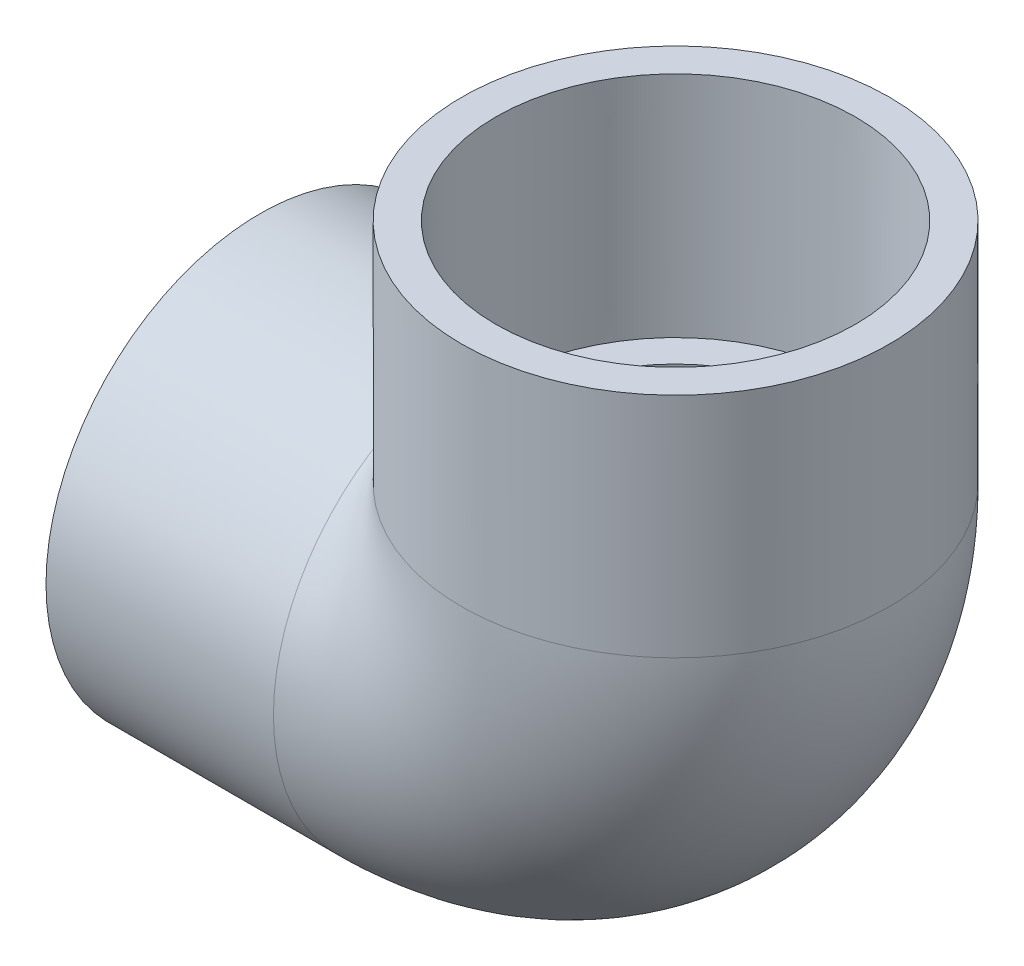
ISO-10303-21;
HEADER;
FILE_DESCRIPTION(('STEP AP214'),'2;1');
FILE_NAME('part.step','',(''),(''),'','','');
FILE_SCHEMA(('AUTOMOTIVE_DESIGN { 1 0 10303 214 1 1 1 1 }'));
ENDSEC;
DATA;
#1=APPLICATION_CONTEXT('core data for automotive mechanical design processes');
#2=APPLICATION_PROTOCOL_DEFINITION('international standard','automotive_design',2000,#1);
#3=PRODUCT_CONTEXT('',#1,'mechanical');
#4=PRODUCT('Part','Part','',(#3));
#5=PRODUCT_RELATED_PRODUCT_CATEGORY('part','',(#4));
#6=PRODUCT_DEFINITION_FORMATION('','',#4);
#7=PRODUCT_DEFINITION_CONTEXT('part definition',#1,'design');
#8=PRODUCT_DEFINITION('design','',#6,#7);
#9=PRODUCT_DEFINITION_SHAPE('','',#8);
#10=(LENGTH_UNIT() NAMED_UNIT(*) SI_UNIT(.MILLI.,.METRE.));
#11=(NAMED_UNIT(*) PLANE_ANGLE_UNIT() SI_UNIT($,.RADIAN.));
#12=(NAMED_UNIT(*) SI_UNIT($,.STERADIAN.) SOLID_ANGLE_UNIT());
#13=UNCERTAINTY_MEASURE_WITH_UNIT(LENGTH_MEASURE(1.E-05),#10,'distance_accuracy_value','');
#14=(GEOMETRIC_REPRESENTATION_CONTEXT(3) GLOBAL_UNCERTAINTY_ASSIGNED_CONTEXT((#13)) GLOBAL_UNIT_ASSIGNED_CONTEXT((#10,
#11,#12)) REPRESENTATION_CONTEXT('',''));
#15=CARTESIAN_POINT('',(0.,0.,0.));
#16=DIRECTION('',(0.,0.,1.));
#17=DIRECTION('',(1.,0.,0.));
#18=AXIS2_PLACEMENT_3D('',#15,#16,#17);
#19=CARTESIAN_POINT('',(-70.1039999999999,-36.068,0.));
#20=DIRECTION('',(-1.,0.,0.));
#21=DIRECTION('',(0.,0.,1.));
#22=AXIS2_PLACEMENT_3D('',#19,#20,#21);
#23=PLANE('',#22);
#24=CARTESIAN_POINT('',(-70.1039999999999,0.,0.));
#25=DIRECTION('',(-1.,0.,0.));
#26=DIRECTION('',(0.,0.,1.));
#27=AXIS2_PLACEMENT_3D('',#24,#25,#26);
#28=CIRCLE('',#27,36.068);
#29=CARTESIAN_POINT('',(-70.1039999999999,0.,36.068));
#30=VERTEX_POINT('',#29);
#31=EDGE_CURVE('E57',#30,#30,#28,.T.);
#32=ORIENTED_EDGE('',*,*,#31,.T.);
#33=EDGE_LOOP('',(#32));
#34=FACE_BOUND('',#33,.T.);
#35=CARTESIAN_POINT('',(-70.1039999999999,0.,0.));
#36=DIRECTION('',(-1.,0.,0.));
#37=DIRECTION('',(0.,0.,1.));
#38=AXIS2_PLACEMENT_3D('',#35,#36,#37);
#39=CIRCLE('',#38,30.3149);
#40=CARTESIAN_POINT('',(-70.1039999999999,0.,30.3149));
#41=VERTEX_POINT('',#40);
#42=EDGE_CURVE('E44',#41,#41,#39,.T.);
#43=ORIENTED_EDGE('',*,*,#42,.F.);
#44=EDGE_LOOP('',(#43));
#45=FACE_BOUND('',#44,.T.);
#46=ADVANCED_FACE('F37',(#34,#45),#23,.T.);
#47=CARTESIAN_POINT('',(-31.7499999999999,0.,0.));
#48=DIRECTION('',(-1.,0.,0.));
#49=DIRECTION('',(0.,0.,1.));
#50=AXIS2_PLACEMENT_3D('',#47,#48,#49);
#51=CONICAL_SURFACE('',#50,30.0863,0.0059601943231777);
#52=ORIENTED_EDGE('',*,*,#42,.T.);
#53=EDGE_LOOP('',(#52));
#54=FACE_BOUND('',#53,.T.);
#55=CARTESIAN_POINT('',(-31.7499999999999,0.,0.));
#56=DIRECTION('',(-1.,0.,0.));
#57=DIRECTION('',(0.,0.,1.));
#58=AXIS2_PLACEMENT_3D('',#55,#56,#57);
#59=CIRCLE('',#58,30.0863);
#60=CARTESIAN_POINT('',(-31.7499999999999,0.,30.0863));
#61=VERTEX_POINT('',#60);
#62=EDGE_CURVE('E68',#61,#61,#59,.T.);
#63=ORIENTED_EDGE('',*,*,#62,.F.);
#64=EDGE_LOOP('',(#63));
#65=FACE_BOUND('',#64,.T.);
#66=ADVANCED_FACE('F77',(#54,#65),#51,.F.);
#67=CARTESIAN_POINT('',(-70.1039999999999,0.,0.));
#68=DIRECTION('',(-1.,0.,0.));
#69=DIRECTION('',(0.,0.,1.));
#70=AXIS2_PLACEMENT_3D('',#67,#68,#69);
#71=CYLINDRICAL_SURFACE('',#70,36.068);
#72=CARTESIAN_POINT('',(0.,0.,0.));
#73=DIRECTION('',(-0.707106781186548,-0.707106781186547,0.));
#74=DIRECTION('',(-0.707106781186548,0.707106781186547,0.));
#75=AXIS2_PLACEMENT_3D('',#72,#73,#74);
#76=ELLIPSE('',#75,51.0078547676728,36.068);
#77=CARTESIAN_POINT('',(-31.7499999999999,31.7500000000002,-17.1125136669047));
#78=VERTEX_POINT('',#77);
#79=CARTESIAN_POINT('',(-31.7499999999999,31.7500000000002,17.1125136669047));
#80=VERTEX_POINT('',#79);
#81=EDGE_CURVE('E56',#78,#80,#76,.F.);
#82=ORIENTED_EDGE('',*,*,#81,.F.);
#83=CARTESIAN_POINT('',(-31.7499999999999,0.,0.));
#84=DIRECTION('',(-1.,0.,0.));
#85=DIRECTION('',(0.,0.,1.));
#86=AXIS2_PLACEMENT_3D('',#83,#84,#85);
#87=CIRCLE('',#86,36.068);
#88=EDGE_CURVE('E63',#78,#80,#87,.T.);
#89=ORIENTED_EDGE('',*,*,#88,.T.);
#90=EDGE_LOOP('',(#82,#89));
#91=FACE_BOUND('',#90,.T.);
#92=ORIENTED_EDGE('',*,*,#31,.F.);
#93=EDGE_LOOP('',(#92));
#94=FACE_BOUND('',#93,.T.);
#95=ADVANCED_FACE('F61',(#91,#94),#71,.T.);
#96=CARTESIAN_POINT('',(-31.7499999999999,31.7500000000002,0.));
#97=DIRECTION('',(0.,0.,-1.));
#98=DIRECTION('',(-1.,0.,0.));
#99=AXIS2_PLACEMENT_3D('',#96,#97,#98);
#100=TOROIDAL_SURFACE('',#99,31.75,24.6253);
#101=CARTESIAN_POINT('',(0.,31.7500000000002,0.));
#102=DIRECTION('',(0.,1.,0.));
#103=DIRECTION('',(0.,0.,-1.));
#104=AXIS2_PLACEMENT_3D('',#101,#102,#103);
#105=CIRCLE('',#104,24.6253);
#106=CARTESIAN_POINT('',(24.6253000000001,31.7500000000002,0.));
#107=VERTEX_POINT('',#106);
#108=EDGE_CURVE('E58',#107,#107,#105,.T.);
#109=CARTESIAN_POINT('',(-31.7499999999999,0.,0.));
#110=DIRECTION('',(1.,0.,0.));
#111=DIRECTION('',(0.,0.,-1.));
#112=AXIS2_PLACEMENT_3D('',#109,#110,#111);
#113=CIRCLE('',#112,24.6253);
#114=CARTESIAN_POINT('',(-31.7499999999999,-24.6252999999998,0.));
#115=VERTEX_POINT('',#114);
#116=EDGE_CURVE('E64',#115,#115,#113,.T.);
#117=CARTESIAN_POINT('',(-31.7499999999999,31.7500000000002,0.));
#118=DIRECTION('',(0.,0.,-1.));
#119=DIRECTION('',(-1.,0.,0.));
#120=AXIS2_PLACEMENT_3D('',#117,#118,#119);
#121=CIRCLE('',#120,56.3753);
#122=EDGE_CURVE('',#107,#115,#121,.T.);
#123=ORIENTED_EDGE('',*,*,#108,.T.);
#124=ORIENTED_EDGE('',*,*,#116,.F.);
#125=ORIENTED_EDGE('',*,*,#122,.T.);
#126=ORIENTED_EDGE('',*,*,#122,.F.);
#127=EDGE_LOOP('',(#123,#125,#124,#126));
#128=FACE_BOUND('',#127,.T.);
#129=ADVANCED_FACE('F87',(#128),#100,.F.);
#130=CARTESIAN_POINT('',(-63.5,31.7500000000002,0.));
#131=DIRECTION('',(0.,-1.,0.));
#132=DIRECTION('',(-1.,0.,0.));
#133=AXIS2_PLACEMENT_3D('',#130,#131,#132);
#134=CIRCLE('',#133,36.068);
#135=TRIMMED_CURVE('',#134,(PARAMETER_VALUE(-2.6472519182026)),
(PARAMETER_VALUE(2.6472519182026)),.T.,.PARAMETER.);
#136=CARTESIAN_POINT('',(-31.7499999999999,31.7500000000002,0.));
#137=DIRECTION('',(0.,0.,-1.));
#138=AXIS1_PLACEMENT('',#136,#137);
#139=SURFACE_OF_REVOLUTION('',#135,#138);
#140=CARTESIAN_POINT('',(0.,31.7500000000002,0.));
#141=DIRECTION('',(0.,1.,0.));
#142=DIRECTION('',(0.,0.,-1.));
#143=AXIS2_PLACEMENT_3D('',#140,#141,#142);
#144=CIRCLE('',#143,36.068);
#145=EDGE_CURVE('E50',#80,#78,#144,.T.);
#146=ORIENTED_EDGE('',*,*,#145,.F.);
#147=ORIENTED_EDGE('',*,*,#88,.F.);
#148=EDGE_LOOP('',(#146,#147));
#149=FACE_BOUND('',#148,.T.);
#150=ADVANCED_FACE('F67',(#149),#139,.T.);
#151=CARTESIAN_POINT('',(0.,31.7500000000002,0.));
#152=DIRECTION('',(0.,1.,0.));
#153=DIRECTION('',(0.,0.,-1.));
#154=AXIS2_PLACEMENT_3D('',#151,#152,#153);
#155=PLANE('',#154);
#156=CARTESIAN_POINT('',(0.,31.7500000000002,0.));
#157=DIRECTION('',(0.,1.,0.));
#158=DIRECTION('',(-1.,0.,0.));
#159=AXIS2_PLACEMENT_3D('',#156,#157,#158);
#160=CIRCLE('',#159,30.0863);
#161=CARTESIAN_POINT('',(-30.0863,31.7500000000002,0.));
#162=VERTEX_POINT('',#161);
#163=EDGE_CURVE('E11',#162,#162,#160,.F.);
#164=ORIENTED_EDGE('',*,*,#163,.F.);
#165=EDGE_LOOP('',(#164));
#166=FACE_BOUND('',#165,.T.);
#167=ORIENTED_EDGE('',*,*,#108,.F.);
#168=EDGE_LOOP('',(#167));
#169=FACE_BOUND('',#168,.T.);
#170=ADVANCED_FACE('F96',(#166,#169),#155,.T.);
#171=CARTESIAN_POINT('',(-31.7499999999999,0.,0.));
#172=DIRECTION('',(1.,0.,0.));
#173=DIRECTION('',(0.,0.,-1.));
#174=AXIS2_PLACEMENT_3D('',#171,#172,#173);
#175=PLANE('',#174);
#176=ORIENTED_EDGE('',*,*,#62,.T.);
#177=EDGE_LOOP('',(#176));
#178=FACE_BOUND('',#177,.T.);
#179=ORIENTED_EDGE('',*,*,#116,.T.);
#180=EDGE_LOOP('',(#179));
#181=FACE_BOUND('',#180,.T.);
#182=ADVANCED_FACE('F100',(#178,#181),#175,.F.);
#183=CARTESIAN_POINT('',(36.068,70.1040000000002,0.));
#184=DIRECTION('',(0.,1.,0.));
#185=DIRECTION('',(0.,0.,1.));
#186=AXIS2_PLACEMENT_3D('',#183,#184,#185);
#187=PLANE('',#186);
#188=CARTESIAN_POINT('',(0.,70.1040000000002,0.));
#189=DIRECTION('',(0.,-1.,0.));
#190=DIRECTION('',(0.,0.,-1.));
#191=AXIS2_PLACEMENT_3D('',#188,#189,#190);
#192=CIRCLE('',#191,30.3149);
#193=CARTESIAN_POINT('',(0.,70.1040000000002,-30.3149));
#194=VERTEX_POINT('',#193);
#195=EDGE_CURVE('E121',#194,#194,#192,.T.);
#196=ORIENTED_EDGE('',*,*,#195,.T.);
#197=EDGE_LOOP('',(#196));
#198=FACE_BOUND('',#197,.T.);
#199=CARTESIAN_POINT('',(0.,70.1040000000002,0.));
#200=DIRECTION('',(0.,-1.,0.));
#201=DIRECTION('',(0.,0.,-1.));
#202=AXIS2_PLACEMENT_3D('',#199,#200,#201);
#203=CIRCLE('',#202,36.068);
#204=CARTESIAN_POINT('',(0.,70.1040000000002,-36.068));
#205=VERTEX_POINT('',#204);
#206=EDGE_CURVE('E65',#205,#205,#203,.T.);
#207=ORIENTED_EDGE('',*,*,#206,.F.);
#208=EDGE_LOOP('',(#207));
#209=FACE_BOUND('',#208,.T.);
#210=ADVANCED_FACE('F104',(#198,#209),#187,.T.);
#211=CARTESIAN_POINT('',(0.,0.,0.));
#212=DIRECTION('',(0.,-1.,0.));
#213=DIRECTION('',(0.,0.,-1.));
#214=AXIS2_PLACEMENT_3D('',#211,#212,#213);
#215=CYLINDRICAL_SURFACE('',#214,36.068);
#216=ORIENTED_EDGE('',*,*,#206,.T.);
#217=EDGE_LOOP('',(#216));
#218=FACE_BOUND('',#217,.T.);
#219=ORIENTED_EDGE('',*,*,#145,.T.);
#220=ORIENTED_EDGE('',*,*,#81,.T.);
#221=EDGE_LOOP('',(#219,#220));
#222=FACE_BOUND('',#221,.T.);
#223=ADVANCED_FACE('F55',(#218,#222),#215,.T.);
#224=CARTESIAN_POINT('',(0.,70.1040000000002,0.));
#225=DIRECTION('',(0.,1.,0.));
#226=DIRECTION('',(0.,0.,1.));
#227=AXIS2_PLACEMENT_3D('',#224,#225,#226);
#228=CONICAL_SURFACE('',#227,30.3149,0.0059601943231777);
#229=ORIENTED_EDGE('',*,*,#163,.T.);
#230=EDGE_LOOP('',(#229));
#231=FACE_BOUND('',#230,.T.);
#232=ORIENTED_EDGE('',*,*,#195,.F.);
#233=EDGE_LOOP('',(#232));
#234=FACE_BOUND('',#233,.T.);
#235=ADVANCED_FACE('F111',(#231,#234),#228,.F.);
#236=CLOSED_SHELL('',(#46,#66,#95,#129,#150,#170,#182,#210,#223,#235));
#237=MANIFOLD_SOLID_BREP('B2',#236);
#238=ADVANCED_BREP_SHAPE_REPRESENTATION('',(#18,#237),#14);
#239=SHAPE_DEFINITION_REPRESENTATION(#9,#238);
ENDSEC;
END-ISO-10303-21;
